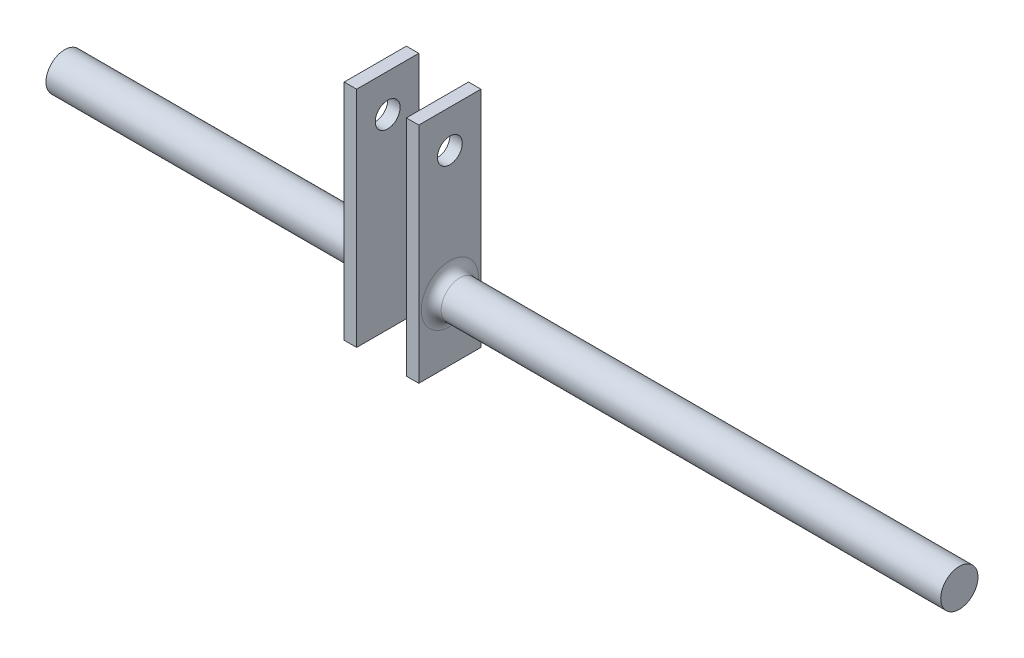
ISO-10303-21;
HEADER;
FILE_DESCRIPTION(('STEP AP214'),'2;1');
FILE_NAME('part.step','',(''),(''),'','','');
FILE_SCHEMA(('AUTOMOTIVE_DESIGN { 1 0 10303 214 1 1 1 1 }'));
ENDSEC;
DATA;
#1=APPLICATION_CONTEXT('core data for automotive mechanical design processes');
#2=APPLICATION_PROTOCOL_DEFINITION('international standard','automotive_design',2000,#1);
#3=PRODUCT_CONTEXT('',#1,'mechanical');
#4=PRODUCT('Part','Part','',(#3));
#5=PRODUCT_RELATED_PRODUCT_CATEGORY('part','',(#4));
#6=PRODUCT_DEFINITION_FORMATION('','',#4);
#7=PRODUCT_DEFINITION_CONTEXT('part definition',#1,'design');
#8=PRODUCT_DEFINITION('design','',#6,#7);
#9=PRODUCT_DEFINITION_SHAPE('','',#8);
#10=(LENGTH_UNIT() NAMED_UNIT(*) SI_UNIT(.MILLI.,.METRE.));
#11=(NAMED_UNIT(*) PLANE_ANGLE_UNIT() SI_UNIT($,.RADIAN.));
#12=(NAMED_UNIT(*) SI_UNIT($,.STERADIAN.) SOLID_ANGLE_UNIT());
#13=UNCERTAINTY_MEASURE_WITH_UNIT(LENGTH_MEASURE(1.E-05),#10,'distance_accuracy_value','');
#14=(GEOMETRIC_REPRESENTATION_CONTEXT(3) GLOBAL_UNCERTAINTY_ASSIGNED_CONTEXT((#13)) GLOBAL_UNIT_ASSIGNED_CONTEXT((#10,
#11,#12)) REPRESENTATION_CONTEXT('',''));
#15=CARTESIAN_POINT('',(0.,0.,0.));
#16=DIRECTION('',(0.,0.,1.));
#17=DIRECTION('',(1.,0.,0.));
#18=AXIS2_PLACEMENT_3D('',#15,#16,#17);
#19=CARTESIAN_POINT('',(180.,0.,0.));
#20=DIRECTION('',(-1.,0.,0.));
#21=DIRECTION('',(0.,0.,1.));
#22=AXIS2_PLACEMENT_3D('',#19,#20,#21);
#23=CYLINDRICAL_SURFACE('',#22,7.5);
#24=CARTESIAN_POINT('',(-59.,0.,0.));
#25=DIRECTION('',(1.,0.,0.));
#26=DIRECTION('',(0.,0.,-1.));
#27=AXIS2_PLACEMENT_3D('',#24,#25,#26);
#28=CIRCLE('',#27,7.5);
#29=CARTESIAN_POINT('',(-59.,0.,-7.5));
#30=VERTEX_POINT('',#29);
#31=EDGE_CURVE('E12',#30,#30,#28,.F.);
#32=ORIENTED_EDGE('',*,*,#31,.T.);
#33=EDGE_LOOP('',(#32));
#34=FACE_BOUND('',#33,.T.);
#35=CARTESIAN_POINT('',(-180.,0.,0.));
#36=DIRECTION('',(1.,0.,0.));
#37=DIRECTION('',(0.,0.,-1.));
#38=AXIS2_PLACEMENT_3D('',#35,#36,#37);
#39=CIRCLE('',#38,7.5);
#40=CARTESIAN_POINT('',(-180.,0.,-7.5));
#41=VERTEX_POINT('',#40);
#42=EDGE_CURVE('E131',#41,#41,#39,.T.);
#43=ORIENTED_EDGE('',*,*,#42,.T.);
#44=EDGE_LOOP('',(#43));
#45=FACE_BOUND('',#44,.T.);
#46=ADVANCED_FACE('F53',(#34,#45),#23,.T.);
#47=CARTESIAN_POINT('',(-180.,0.,0.));
#48=DIRECTION('',(1.,0.,0.));
#49=DIRECTION('',(0.,0.,-1.));
#50=AXIS2_PLACEMENT_3D('',#47,#48,#49);
#51=PLANE('',#50);
#52=ORIENTED_EDGE('',*,*,#42,.F.);
#53=EDGE_LOOP('',(#52));
#54=FACE_BOUND('',#53,.T.);
#55=ADVANCED_FACE('F152',(#54),#51,.F.);
#56=CARTESIAN_POINT('',(-50.,65.,12.5));
#57=DIRECTION('',(0.,0.,-1.));
#58=DIRECTION('',(0.,1.,0.));
#59=AXIS2_PLACEMENT_3D('',#56,#57,#58);
#60=PLANE('',#59);
#61=DIRECTION('',(0.,-1.,0.));
#62=VECTOR('',#61,1.);
#63=CARTESIAN_POINT('',(-55.,65.,12.5));
#64=LINE('',#63,#62);
#65=CARTESIAN_POINT('',(-55.,65.,12.5));
#66=VERTEX_POINT('',#65);
#67=CARTESIAN_POINT('',(-55.,-25.,12.5));
#68=VERTEX_POINT('',#67);
#69=EDGE_CURVE('E121',#66,#68,#64,.T.);
#70=ORIENTED_EDGE('',*,*,#69,.T.);
#71=DIRECTION('',(-1.,0.,0.));
#72=VECTOR('',#71,1.);
#73=CARTESIAN_POINT('',(-50.,-25.,12.5));
#74=LINE('',#73,#72);
#75=CARTESIAN_POINT('',(-50.,-25.,12.5));
#76=VERTEX_POINT('',#75);
#77=EDGE_CURVE('E112',#76,#68,#74,.T.);
#78=ORIENTED_EDGE('',*,*,#77,.F.);
#79=DIRECTION('',(0.,-1.,0.));
#80=VECTOR('',#79,1.);
#81=CARTESIAN_POINT('',(-50.,65.,12.5));
#82=LINE('',#81,#80);
#83=CARTESIAN_POINT('',(-50.,65.,12.5));
#84=VERTEX_POINT('',#83);
#85=EDGE_CURVE('E106',#84,#76,#82,.T.);
#86=ORIENTED_EDGE('',*,*,#85,.F.);
#87=DIRECTION('',(-1.,0.,0.));
#88=VECTOR('',#87,1.);
#89=CARTESIAN_POINT('',(-50.,65.,12.5));
#90=LINE('',#89,#88);
#91=EDGE_CURVE('E117',#84,#66,#90,.T.);
#92=ORIENTED_EDGE('',*,*,#91,.T.);
#93=EDGE_LOOP('',(#70,#78,#86,#92));
#94=FACE_BOUND('',#93,.T.);
#95=ADVANCED_FACE('F157',(#94),#60,.F.);
#96=CARTESIAN_POINT('',(-50.,-25.,12.5));
#97=DIRECTION('',(0.,1.,0.));
#98=DIRECTION('',(0.,0.,1.));
#99=AXIS2_PLACEMENT_3D('',#96,#97,#98);
#100=PLANE('',#99);
#101=DIRECTION('',(0.,0.,-1.));
#102=VECTOR('',#101,1.);
#103=CARTESIAN_POINT('',(-55.,-25.,12.5));
#104=LINE('',#103,#102);
#105=CARTESIAN_POINT('',(-55.,-25.,-12.5));
#106=VERTEX_POINT('',#105);
#107=EDGE_CURVE('E111',#68,#106,#104,.T.);
#108=ORIENTED_EDGE('',*,*,#107,.T.);
#109=DIRECTION('',(-1.,0.,0.));
#110=VECTOR('',#109,1.);
#111=CARTESIAN_POINT('',(-50.,-25.,-12.5));
#112=LINE('',#111,#110);
#113=CARTESIAN_POINT('',(-50.,-25.,-12.5));
#114=VERTEX_POINT('',#113);
#115=EDGE_CURVE('E109',#114,#106,#112,.T.);
#116=ORIENTED_EDGE('',*,*,#115,.F.);
#117=DIRECTION('',(0.,0.,-1.));
#118=VECTOR('',#117,1.);
#119=CARTESIAN_POINT('',(-50.,-25.,12.5));
#120=LINE('',#119,#118);
#121=EDGE_CURVE('E101',#76,#114,#120,.T.);
#122=ORIENTED_EDGE('',*,*,#121,.F.);
#123=ORIENTED_EDGE('',*,*,#77,.T.);
#124=EDGE_LOOP('',(#108,#116,#122,#123));
#125=FACE_BOUND('',#124,.T.);
#126=ADVANCED_FACE('F110',(#125),#100,.F.);
#127=CARTESIAN_POINT('',(-50.,65.,-12.5));
#128=DIRECTION('',(0.,0.,1.));
#129=DIRECTION('',(0.,-1.,0.));
#130=AXIS2_PLACEMENT_3D('',#127,#128,#129);
#131=PLANE('',#130);
#132=DIRECTION('',(0.,1.,0.));
#133=VECTOR('',#132,1.);
#134=CARTESIAN_POINT('',(-55.,65.,-12.5));
#135=LINE('',#134,#133);
#136=CARTESIAN_POINT('',(-55.,65.,-12.5));
#137=VERTEX_POINT('',#136);
#138=EDGE_CURVE('E87',#106,#137,#135,.T.);
#139=ORIENTED_EDGE('',*,*,#138,.T.);
#140=DIRECTION('',(-1.,0.,0.));
#141=VECTOR('',#140,1.);
#142=CARTESIAN_POINT('',(-50.,65.,-12.5));
#143=LINE('',#142,#141);
#144=CARTESIAN_POINT('',(-50.,65.,-12.5));
#145=VERTEX_POINT('',#144);
#146=EDGE_CURVE('E113',#145,#137,#143,.T.);
#147=ORIENTED_EDGE('',*,*,#146,.F.);
#148=DIRECTION('',(0.,1.,0.));
#149=VECTOR('',#148,1.);
#150=CARTESIAN_POINT('',(-50.,65.,-12.5));
#151=LINE('',#150,#149);
#152=EDGE_CURVE('E104',#114,#145,#151,.T.);
#153=ORIENTED_EDGE('',*,*,#152,.F.);
#154=ORIENTED_EDGE('',*,*,#115,.T.);
#155=EDGE_LOOP('',(#139,#147,#153,#154));
#156=FACE_BOUND('',#155,.T.);
#157=ADVANCED_FACE('F115',(#156),#131,.F.);
#158=CARTESIAN_POINT('',(-50.,65.,12.5));
#159=DIRECTION('',(0.,-1.,0.));
#160=DIRECTION('',(0.,0.,-1.));
#161=AXIS2_PLACEMENT_3D('',#158,#159,#160);
#162=PLANE('',#161);
#163=DIRECTION('',(0.,0.,1.));
#164=VECTOR('',#163,1.);
#165=CARTESIAN_POINT('',(-55.,65.,12.5));
#166=LINE('',#165,#164);
#167=EDGE_CURVE('E93',#137,#66,#166,.T.);
#168=ORIENTED_EDGE('',*,*,#167,.T.);
#169=ORIENTED_EDGE('',*,*,#91,.F.);
#170=DIRECTION('',(0.,0.,1.));
#171=VECTOR('',#170,1.);
#172=CARTESIAN_POINT('',(-50.,65.,12.5));
#173=LINE('',#172,#171);
#174=EDGE_CURVE('E70',#145,#84,#173,.T.);
#175=ORIENTED_EDGE('',*,*,#174,.F.);
#176=ORIENTED_EDGE('',*,*,#146,.T.);
#177=EDGE_LOOP('',(#168,#169,#175,#176));
#178=FACE_BOUND('',#177,.T.);
#179=ADVANCED_FACE('F169',(#178),#162,.F.);
#180=CARTESIAN_POINT('',(-50.,0.,0.));
#181=DIRECTION('',(1.,0.,0.));
#182=DIRECTION('',(0.,0.,-1.));
#183=AXIS2_PLACEMENT_3D('',#180,#181,#182);
#184=PLANE('',#183);
#185=CARTESIAN_POINT('',(-50.,49.9099188538711,0.));
#186=DIRECTION('',(1.,0.,0.));
#187=DIRECTION('',(0.,0.,-1.));
#188=AXIS2_PLACEMENT_3D('',#185,#186,#187);
#189=CIRCLE('',#188,5.);
#190=CARTESIAN_POINT('',(-50.,49.9099188538711,-5.00000000000002));
#191=VERTEX_POINT('',#190);
#192=EDGE_CURVE('E124',#191,#191,#189,.T.);
#193=ORIENTED_EDGE('',*,*,#192,.F.);
#194=EDGE_LOOP('',(#193));
#195=FACE_BOUND('',#194,.T.);
#196=ORIENTED_EDGE('',*,*,#85,.T.);
#197=ORIENTED_EDGE('',*,*,#121,.T.);
#198=ORIENTED_EDGE('',*,*,#152,.T.);
#199=ORIENTED_EDGE('',*,*,#174,.T.);
#200=EDGE_LOOP('',(#196,#197,#198,#199));
#201=FACE_BOUND('',#200,.T.);
#202=ADVANCED_FACE('F102',(#195,#201),#184,.T.);
#203=CARTESIAN_POINT('',(-55.,0.,0.));
#204=DIRECTION('',(1.,0.,0.));
#205=DIRECTION('',(0.,0.,-1.));
#206=AXIS2_PLACEMENT_3D('',#203,#204,#205);
#207=PLANE('',#206);
#208=CARTESIAN_POINT('',(-55.,0.,0.));
#209=DIRECTION('',(1.,0.,0.));
#210=DIRECTION('',(0.,0.,-1.));
#211=AXIS2_PLACEMENT_3D('',#208,#209,#210);
#212=CIRCLE('',#211,11.5);
#213=CARTESIAN_POINT('',(-55.,0.,-11.5));
#214=VERTEX_POINT('',#213);
#215=EDGE_CURVE('E62',#214,#214,#212,.T.);
#216=ORIENTED_EDGE('',*,*,#215,.T.);
#217=EDGE_LOOP('',(#216));
#218=FACE_BOUND('',#217,.T.);
#219=CARTESIAN_POINT('',(-55.,49.9099188538711,0.));
#220=DIRECTION('',(1.,0.,0.));
#221=DIRECTION('',(0.,0.,-1.));
#222=AXIS2_PLACEMENT_3D('',#219,#220,#221);
#223=CIRCLE('',#222,5.);
#224=CARTESIAN_POINT('',(-55.,49.9099188538711,-5.00000000000002));
#225=VERTEX_POINT('',#224);
#226=EDGE_CURVE('E134',#225,#225,#223,.T.);
#227=ORIENTED_EDGE('',*,*,#226,.T.);
#228=EDGE_LOOP('',(#227));
#229=FACE_BOUND('',#228,.T.);
#230=ORIENTED_EDGE('',*,*,#69,.F.);
#231=ORIENTED_EDGE('',*,*,#167,.F.);
#232=ORIENTED_EDGE('',*,*,#138,.F.);
#233=ORIENTED_EDGE('',*,*,#107,.F.);
#234=EDGE_LOOP('',(#230,#231,#232,#233));
#235=FACE_BOUND('',#234,.T.);
#236=ADVANCED_FACE('F139',(#218,#229,#235),#207,.F.);
#237=CARTESIAN_POINT('',(180.,49.9099188538711,0.));
#238=DIRECTION('',(-1.,0.,0.));
#239=DIRECTION('',(0.,0.,1.));
#240=AXIS2_PLACEMENT_3D('',#237,#238,#239);
#241=CYLINDRICAL_SURFACE('',#240,5.);
#242=ORIENTED_EDGE('',*,*,#192,.T.);
#243=EDGE_LOOP('',(#242));
#244=FACE_BOUND('',#243,.T.);
#245=ORIENTED_EDGE('',*,*,#226,.F.);
#246=EDGE_LOOP('',(#245));
#247=FACE_BOUND('',#246,.T.);
#248=ADVANCED_FACE('F143',(#244,#247),#241,.F.);
#249=CARTESIAN_POINT('',(-59.,0.,0.));
#250=DIRECTION('',(1.,0.,0.));
#251=DIRECTION('',(0.,0.,-1.));
#252=AXIS2_PLACEMENT_3D('',#249,#250,#251);
#253=TOROIDAL_SURFACE('',#252,11.5,4.);
#254=ORIENTED_EDGE('',*,*,#31,.F.);
#255=EDGE_LOOP('',(#254));
#256=FACE_BOUND('',#255,.T.);
#257=ORIENTED_EDGE('',*,*,#215,.F.);
#258=EDGE_LOOP('',(#257));
#259=FACE_BOUND('',#258,.T.);
#260=ADVANCED_FACE('F55',(#256,#259),#253,.F.);
#261=CLOSED_SHELL('',(#46,#55,#95,#126,#157,#179,#202,#236,#248,#260));
#262=MANIFOLD_SOLID_BREP('B2',#261);
#263=CARTESIAN_POINT('',(180.,0.,0.));
#264=DIRECTION('',(1.,0.,0.));
#265=DIRECTION('',(0.,0.,-1.));
#266=AXIS2_PLACEMENT_3D('',#263,#264,#265);
#267=PLANE('',#266);
#268=CARTESIAN_POINT('',(180.,0.,0.));
#269=DIRECTION('',(1.,0.,0.));
#270=DIRECTION('',(0.,0.,-1.));
#271=AXIS2_PLACEMENT_3D('',#268,#269,#270);
#272=CIRCLE('',#271,7.5);
#273=CARTESIAN_POINT('',(180.,0.,-7.5));
#274=VERTEX_POINT('',#273);
#275=EDGE_CURVE('E353',#274,#274,#272,.T.);
#276=ORIENTED_EDGE('',*,*,#275,.T.);
#277=EDGE_LOOP('',(#276));
#278=FACE_BOUND('',#277,.T.);
#279=ADVANCED_FACE('F263',(#278),#267,.T.);
#280=CARTESIAN_POINT('',(180.,0.,0.));
#281=DIRECTION('',(-1.,0.,0.));
#282=DIRECTION('',(0.,0.,1.));
#283=AXIS2_PLACEMENT_3D('',#280,#281,#282);
#284=CYLINDRICAL_SURFACE('',#283,7.5);
#285=CARTESIAN_POINT('',(-21.,0.,0.));
#286=DIRECTION('',(-1.,0.,0.));
#287=DIRECTION('',(0.,-1.,0.));
#288=AXIS2_PLACEMENT_3D('',#285,#286,#287);
#289=CIRCLE('',#288,7.5);
#290=CARTESIAN_POINT('',(-21.,-7.5,0.));
#291=VERTEX_POINT('',#290);
#292=EDGE_CURVE('E51',#291,#291,#289,.F.);
#293=ORIENTED_EDGE('',*,*,#292,.T.);
#294=EDGE_LOOP('',(#293));
#295=FACE_BOUND('',#294,.T.);
#296=ORIENTED_EDGE('',*,*,#275,.F.);
#297=EDGE_LOOP('',(#296));
#298=FACE_BOUND('',#297,.T.);
#299=ADVANCED_FACE('F377',(#295,#298),#284,.T.);
#300=CARTESIAN_POINT('',(-30.,65.,-12.5));
#301=DIRECTION('',(0.,0.,1.));
#302=DIRECTION('',(0.,-1.,0.));
#303=AXIS2_PLACEMENT_3D('',#300,#301,#302);
#304=PLANE('',#303);
#305=DIRECTION('',(0.,-1.,0.));
#306=VECTOR('',#305,1.);
#307=CARTESIAN_POINT('',(-25.,65.,-12.5));
#308=LINE('',#307,#306);
#309=CARTESIAN_POINT('',(-25.,65.,-12.5));
#310=VERTEX_POINT('',#309);
#311=CARTESIAN_POINT('',(-25.,-25.,-12.5));
#312=VERTEX_POINT('',#311);
#313=EDGE_CURVE('E336',#310,#312,#308,.T.);
#314=ORIENTED_EDGE('',*,*,#313,.T.);
#315=DIRECTION('',(1.,0.,0.));
#316=VECTOR('',#315,1.);
#317=CARTESIAN_POINT('',(-30.,-25.,-12.5));
#318=LINE('',#317,#316);
#319=CARTESIAN_POINT('',(-30.,-25.,-12.5));
#320=VERTEX_POINT('',#319);
#321=EDGE_CURVE('E325',#320,#312,#318,.T.);
#322=ORIENTED_EDGE('',*,*,#321,.F.);
#323=DIRECTION('',(0.,-1.,0.));
#324=VECTOR('',#323,1.);
#325=CARTESIAN_POINT('',(-30.,65.,-12.5));
#326=LINE('',#325,#324);
#327=CARTESIAN_POINT('',(-30.,65.,-12.5));
#328=VERTEX_POINT('',#327);
#329=EDGE_CURVE('E317',#328,#320,#326,.T.);
#330=ORIENTED_EDGE('',*,*,#329,.F.);
#331=DIRECTION('',(1.,0.,0.));
#332=VECTOR('',#331,1.);
#333=CARTESIAN_POINT('',(-30.,65.,-12.5));
#334=LINE('',#333,#332);
#335=EDGE_CURVE('E332',#328,#310,#334,.T.);
#336=ORIENTED_EDGE('',*,*,#335,.T.);
#337=EDGE_LOOP('',(#314,#322,#330,#336));
#338=FACE_BOUND('',#337,.T.);
#339=ADVANCED_FACE('F383',(#338),#304,.F.);
#340=CARTESIAN_POINT('',(-30.,-25.,-12.5));
#341=DIRECTION('',(0.,1.,0.));
#342=DIRECTION('',(0.,0.,1.));
#343=AXIS2_PLACEMENT_3D('',#340,#341,#342);
#344=PLANE('',#343);
#345=DIRECTION('',(0.,0.,1.));
#346=VECTOR('',#345,1.);
#347=CARTESIAN_POINT('',(-25.,-25.,-12.5));
#348=LINE('',#347,#346);
#349=CARTESIAN_POINT('',(-25.,-25.,12.5));
#350=VERTEX_POINT('',#349);
#351=EDGE_CURVE('E323',#312,#350,#348,.T.);
#352=ORIENTED_EDGE('',*,*,#351,.T.);
#353=DIRECTION('',(1.,0.,0.));
#354=VECTOR('',#353,1.);
#355=CARTESIAN_POINT('',(-30.,-25.,12.5));
#356=LINE('',#355,#354);
#357=CARTESIAN_POINT('',(-30.,-25.,12.5));
#358=VERTEX_POINT('',#357);
#359=EDGE_CURVE('E321',#358,#350,#356,.T.);
#360=ORIENTED_EDGE('',*,*,#359,.F.);
#361=DIRECTION('',(0.,0.,1.));
#362=VECTOR('',#361,1.);
#363=CARTESIAN_POINT('',(-30.,-25.,-12.5));
#364=LINE('',#363,#362);
#365=EDGE_CURVE('E312',#320,#358,#364,.T.);
#366=ORIENTED_EDGE('',*,*,#365,.F.);
#367=ORIENTED_EDGE('',*,*,#321,.T.);
#368=EDGE_LOOP('',(#352,#360,#366,#367));
#369=FACE_BOUND('',#368,.T.);
#370=ADVANCED_FACE('F322',(#369),#344,.F.);
#371=CARTESIAN_POINT('',(-30.,65.,12.5));
#372=DIRECTION('',(0.,0.,-1.));
#373=DIRECTION('',(0.,1.,0.));
#374=AXIS2_PLACEMENT_3D('',#371,#372,#373);
#375=PLANE('',#374);
#376=DIRECTION('',(0.,1.,0.));
#377=VECTOR('',#376,1.);
#378=CARTESIAN_POINT('',(-25.,65.,12.5));
#379=LINE('',#378,#377);
#380=CARTESIAN_POINT('',(-25.,65.,12.5));
#381=VERTEX_POINT('',#380);
#382=EDGE_CURVE('E298',#350,#381,#379,.T.);
#383=ORIENTED_EDGE('',*,*,#382,.T.);
#384=DIRECTION('',(1.,0.,0.));
#385=VECTOR('',#384,1.);
#386=CARTESIAN_POINT('',(-30.,65.,12.5));
#387=LINE('',#386,#385);
#388=CARTESIAN_POINT('',(-30.,65.,12.5));
#389=VERTEX_POINT('',#388);
#390=EDGE_CURVE('E326',#389,#381,#387,.T.);
#391=ORIENTED_EDGE('',*,*,#390,.F.);
#392=DIRECTION('',(0.,1.,0.));
#393=VECTOR('',#392,1.);
#394=CARTESIAN_POINT('',(-30.,65.,12.5));
#395=LINE('',#394,#393);
#396=EDGE_CURVE('E315',#358,#389,#395,.T.);
#397=ORIENTED_EDGE('',*,*,#396,.F.);
#398=ORIENTED_EDGE('',*,*,#359,.T.);
#399=EDGE_LOOP('',(#383,#391,#397,#398));
#400=FACE_BOUND('',#399,.T.);
#401=ADVANCED_FACE('F328',(#400),#375,.F.);
#402=CARTESIAN_POINT('',(-30.,65.,-12.5));
#403=DIRECTION('',(0.,-1.,0.));
#404=DIRECTION('',(1.,0.,0.));
#405=AXIS2_PLACEMENT_3D('',#402,#403,#404);
#406=PLANE('',#405);
#407=DIRECTION('',(0.,0.,-1.));
#408=VECTOR('',#407,1.);
#409=CARTESIAN_POINT('',(-25.,65.,-12.5));
#410=LINE('',#409,#408);
#411=EDGE_CURVE('E304',#381,#310,#410,.T.);
#412=ORIENTED_EDGE('',*,*,#411,.T.);
#413=ORIENTED_EDGE('',*,*,#335,.F.);
#414=DIRECTION('',(0.,0.,-1.));
#415=VECTOR('',#414,1.);
#416=CARTESIAN_POINT('',(-30.,65.,-12.5));
#417=LINE('',#416,#415);
#418=EDGE_CURVE('E281',#389,#328,#417,.T.);
#419=ORIENTED_EDGE('',*,*,#418,.F.);
#420=ORIENTED_EDGE('',*,*,#390,.T.);
#421=EDGE_LOOP('',(#412,#413,#419,#420));
#422=FACE_BOUND('',#421,.T.);
#423=ADVANCED_FACE('F393',(#422),#406,.F.);
#424=CARTESIAN_POINT('',(-30.,0.,0.));
#425=DIRECTION('',(-1.,0.,0.));
#426=DIRECTION('',(0.,-1.,0.));
#427=AXIS2_PLACEMENT_3D('',#424,#425,#426);
#428=PLANE('',#427);
#429=CARTESIAN_POINT('',(-30.,49.9099188538711,0.));
#430=DIRECTION('',(-1.,0.,0.));
#431=DIRECTION('',(0.,-1.,0.));
#432=AXIS2_PLACEMENT_3D('',#429,#430,#431);
#433=CIRCLE('',#432,5.);
#434=CARTESIAN_POINT('',(-30.,44.9099188538711,0.));
#435=VERTEX_POINT('',#434);
#436=EDGE_CURVE('E340',#435,#435,#433,.T.);
#437=ORIENTED_EDGE('',*,*,#436,.F.);
#438=EDGE_LOOP('',(#437));
#439=FACE_BOUND('',#438,.T.);
#440=ORIENTED_EDGE('',*,*,#329,.T.);
#441=ORIENTED_EDGE('',*,*,#365,.T.);
#442=ORIENTED_EDGE('',*,*,#396,.T.);
#443=ORIENTED_EDGE('',*,*,#418,.T.);
#444=EDGE_LOOP('',(#440,#441,#442,#443));
#445=FACE_BOUND('',#444,.T.);
#446=ADVANCED_FACE('F313',(#439,#445),#428,.T.);
#447=CARTESIAN_POINT('',(-25.,0.,0.));
#448=DIRECTION('',(-1.,0.,0.));
#449=DIRECTION('',(0.,-1.,0.));
#450=AXIS2_PLACEMENT_3D('',#447,#448,#449);
#451=PLANE('',#450);
#452=CARTESIAN_POINT('',(-25.,0.,0.));
#453=DIRECTION('',(-1.,0.,0.));
#454=DIRECTION('',(0.,-1.,0.));
#455=AXIS2_PLACEMENT_3D('',#452,#453,#454);
#456=CIRCLE('',#455,11.5);
#457=CARTESIAN_POINT('',(-25.,-11.5,0.));
#458=VERTEX_POINT('',#457);
#459=EDGE_CURVE('E273',#458,#458,#456,.T.);
#460=ORIENTED_EDGE('',*,*,#459,.T.);
#461=EDGE_LOOP('',(#460));
#462=FACE_BOUND('',#461,.T.);
#463=CARTESIAN_POINT('',(-25.,49.9099188538711,0.));
#464=DIRECTION('',(-1.,0.,0.));
#465=DIRECTION('',(0.,-1.,0.));
#466=AXIS2_PLACEMENT_3D('',#463,#464,#465);
#467=CIRCLE('',#466,5.);
#468=CARTESIAN_POINT('',(-25.,44.9099188538711,0.));
#469=VERTEX_POINT('',#468);
#470=EDGE_CURVE('E357',#469,#469,#467,.T.);
#471=ORIENTED_EDGE('',*,*,#470,.T.);
#472=EDGE_LOOP('',(#471));
#473=FACE_BOUND('',#472,.T.);
#474=ORIENTED_EDGE('',*,*,#313,.F.);
#475=ORIENTED_EDGE('',*,*,#411,.F.);
#476=ORIENTED_EDGE('',*,*,#382,.F.);
#477=ORIENTED_EDGE('',*,*,#351,.F.);
#478=EDGE_LOOP('',(#474,#475,#476,#477));
#479=FACE_BOUND('',#478,.T.);
#480=ADVANCED_FACE('F364',(#462,#473,#479),#451,.F.);
#481=CARTESIAN_POINT('',(180.,49.9099188538711,0.));
#482=DIRECTION('',(-1.,0.,0.));
#483=DIRECTION('',(0.,0.,1.));
#484=AXIS2_PLACEMENT_3D('',#481,#482,#483);
#485=CYLINDRICAL_SURFACE('',#484,5.);
#486=ORIENTED_EDGE('',*,*,#436,.T.);
#487=EDGE_LOOP('',(#486));
#488=FACE_BOUND('',#487,.T.);
#489=ORIENTED_EDGE('',*,*,#470,.F.);
#490=EDGE_LOOP('',(#489));
#491=FACE_BOUND('',#490,.T.);
#492=ADVANCED_FACE('F368',(#488,#491),#485,.F.);
#493=CARTESIAN_POINT('',(-21.,0.,0.));
#494=DIRECTION('',(-1.,0.,0.));
#495=DIRECTION('',(0.,-1.,0.));
#496=AXIS2_PLACEMENT_3D('',#493,#494,#495);
#497=TOROIDAL_SURFACE('',#496,11.5,4.);
#498=ORIENTED_EDGE('',*,*,#292,.F.);
#499=EDGE_LOOP('',(#498));
#500=FACE_BOUND('',#499,.T.);
#501=ORIENTED_EDGE('',*,*,#459,.F.);
#502=EDGE_LOOP('',(#501));
#503=FACE_BOUND('',#502,.T.);
#504=ADVANCED_FACE('F265',(#500,#503),#497,.F.);
#505=CLOSED_SHELL('',(#279,#299,#339,#370,#401,#423,#446,#480,#492,#504));
#506=MANIFOLD_SOLID_BREP('B6',#505);
#507=ADVANCED_BREP_SHAPE_REPRESENTATION('',(#18,#262,#506),#14);
#508=SHAPE_DEFINITION_REPRESENTATION(#9,#507);
ENDSEC;
END-ISO-10303-21;
